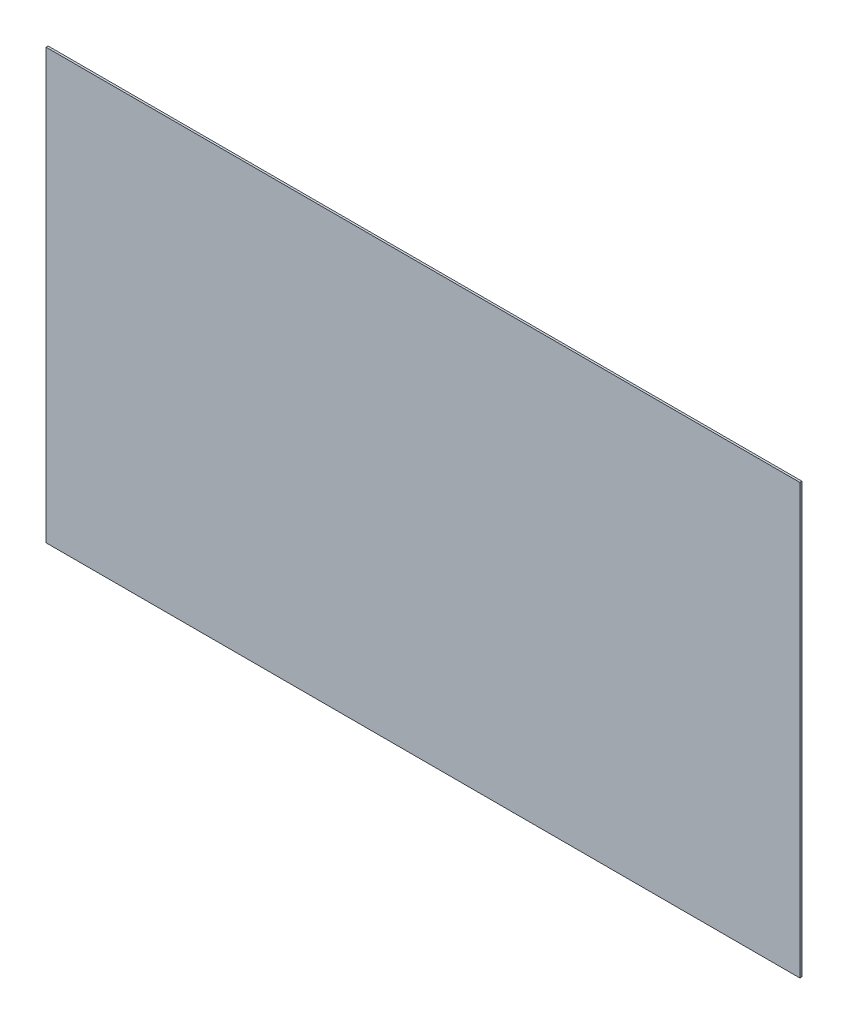
ISO-10303-21;
HEADER;
FILE_DESCRIPTION(('STEP AP214'),'2;1');
FILE_NAME('part.step','',(''),(''),'','','');
FILE_SCHEMA(('AUTOMOTIVE_DESIGN { 1 0 10303 214 1 1 1 1 }'));
ENDSEC;
DATA;
#1=APPLICATION_CONTEXT('core data for automotive mechanical design processes');
#2=APPLICATION_PROTOCOL_DEFINITION('international standard','automotive_design',2000,#1);
#3=PRODUCT_CONTEXT('',#1,'mechanical');
#4=PRODUCT('Part','Part','',(#3));
#5=PRODUCT_RELATED_PRODUCT_CATEGORY('part','',(#4));
#6=PRODUCT_DEFINITION_FORMATION('','',#4);
#7=PRODUCT_DEFINITION_CONTEXT('part definition',#1,'design');
#8=PRODUCT_DEFINITION('design','',#6,#7);
#9=PRODUCT_DEFINITION_SHAPE('','',#8);
#10=(LENGTH_UNIT() NAMED_UNIT(*) SI_UNIT(.MILLI.,.METRE.));
#11=(NAMED_UNIT(*) PLANE_ANGLE_UNIT() SI_UNIT($,.RADIAN.));
#12=(NAMED_UNIT(*) SI_UNIT($,.STERADIAN.) SOLID_ANGLE_UNIT());
#13=UNCERTAINTY_MEASURE_WITH_UNIT(LENGTH_MEASURE(1.E-05),#10,'distance_accuracy_value','');
#14=(GEOMETRIC_REPRESENTATION_CONTEXT(3) GLOBAL_UNCERTAINTY_ASSIGNED_CONTEXT((#13)) GLOBAL_UNIT_ASSIGNED_CONTEXT((#10,
#11,#12)) REPRESENTATION_CONTEXT('',''));
#15=CARTESIAN_POINT('',(0.,0.,0.));
#16=DIRECTION('',(0.,0.,1.));
#17=DIRECTION('',(1.,0.,0.));
#18=AXIS2_PLACEMENT_3D('',#15,#16,#17);
#19=CARTESIAN_POINT('',(0.,0.,2.));
#20=DIRECTION('',(1.,0.,0.));
#21=DIRECTION('',(0.,0.,-1.));
#22=AXIS2_PLACEMENT_3D('',#19,#20,#21);
#23=PLANE('',#22);
#24=DIRECTION('',(0.,-1.,0.));
#25=VECTOR('',#24,1.);
#26=CARTESIAN_POINT('',(0.,0.,0.));
#27=LINE('',#26,#25);
#28=CARTESIAN_POINT('',(0.,410.,0.));
#29=VERTEX_POINT('',#28);
#30=CARTESIAN_POINT('',(0.,0.,0.));
#31=VERTEX_POINT('',#30);
#32=EDGE_CURVE('E97',#29,#31,#27,.T.);
#33=ORIENTED_EDGE('',*,*,#32,.T.);
#34=DIRECTION('',(0.,0.,-1.));
#35=VECTOR('',#34,1.);
#36=CARTESIAN_POINT('',(0.,0.,2.));
#37=LINE('',#36,#35);
#38=CARTESIAN_POINT('',(0.,0.,2.));
#39=VERTEX_POINT('',#38);
#40=EDGE_CURVE('E11',#39,#31,#37,.T.);
#41=ORIENTED_EDGE('',*,*,#40,.F.);
#42=DIRECTION('',(0.,-1.,0.));
#43=VECTOR('',#42,1.);
#44=CARTESIAN_POINT('',(0.,0.,2.));
#45=LINE('',#44,#43);
#46=CARTESIAN_POINT('',(0.,410.,2.));
#47=VERTEX_POINT('',#46);
#48=EDGE_CURVE('E85',#47,#39,#45,.T.);
#49=ORIENTED_EDGE('',*,*,#48,.F.);
#50=DIRECTION('',(0.,0.,-1.));
#51=VECTOR('',#50,1.);
#52=CARTESIAN_POINT('',(0.,410.,2.));
#53=LINE('',#52,#51);
#54=EDGE_CURVE('E93',#47,#29,#53,.T.);
#55=ORIENTED_EDGE('',*,*,#54,.T.);
#56=EDGE_LOOP('',(#33,#41,#49,#55));
#57=FACE_BOUND('',#56,.T.);
#58=ADVANCED_FACE('F34',(#57),#23,.F.);
#59=CARTESIAN_POINT('',(0.,0.,2.));
#60=DIRECTION('',(0.,1.,0.));
#61=DIRECTION('',(0.,0.,1.));
#62=AXIS2_PLACEMENT_3D('',#59,#60,#61);
#63=PLANE('',#62);
#64=DIRECTION('',(1.,0.,0.));
#65=VECTOR('',#64,1.);
#66=CARTESIAN_POINT('',(0.,0.,0.));
#67=LINE('',#66,#65);
#68=CARTESIAN_POINT('',(720.,0.,0.));
#69=VERTEX_POINT('',#68);
#70=EDGE_CURVE('E89',#31,#69,#67,.T.);
#71=ORIENTED_EDGE('',*,*,#70,.T.);
#72=DIRECTION('',(0.,0.,-1.));
#73=VECTOR('',#72,1.);
#74=CARTESIAN_POINT('',(720.,0.,2.));
#75=LINE('',#74,#73);
#76=CARTESIAN_POINT('',(720.,0.,2.));
#77=VERTEX_POINT('',#76);
#78=EDGE_CURVE('E42',#77,#69,#75,.T.);
#79=ORIENTED_EDGE('',*,*,#78,.F.);
#80=DIRECTION('',(1.,0.,0.));
#81=VECTOR('',#80,1.);
#82=CARTESIAN_POINT('',(0.,0.,2.));
#83=LINE('',#82,#81);
#84=EDGE_CURVE('E80',#39,#77,#83,.T.);
#85=ORIENTED_EDGE('',*,*,#84,.F.);
#86=ORIENTED_EDGE('',*,*,#40,.T.);
#87=EDGE_LOOP('',(#71,#79,#85,#86));
#88=FACE_BOUND('',#87,.T.);
#89=ADVANCED_FACE('F88',(#88),#63,.F.);
#90=CARTESIAN_POINT('',(720.,0.,2.));
#91=DIRECTION('',(-1.,0.,0.));
#92=DIRECTION('',(0.,0.,1.));
#93=AXIS2_PLACEMENT_3D('',#90,#91,#92);
#94=PLANE('',#93);
#95=DIRECTION('',(0.,1.,0.));
#96=VECTOR('',#95,1.);
#97=CARTESIAN_POINT('',(720.,0.,0.));
#98=LINE('',#97,#96);
#99=CARTESIAN_POINT('',(720.,410.,0.));
#100=VERTEX_POINT('',#99);
#101=EDGE_CURVE('E67',#69,#100,#98,.T.);
#102=ORIENTED_EDGE('',*,*,#101,.T.);
#103=DIRECTION('',(0.,0.,-1.));
#104=VECTOR('',#103,1.);
#105=CARTESIAN_POINT('',(720.,410.,2.));
#106=LINE('',#105,#104);
#107=CARTESIAN_POINT('',(720.,410.,2.));
#108=VERTEX_POINT('',#107);
#109=EDGE_CURVE('E90',#108,#100,#106,.T.);
#110=ORIENTED_EDGE('',*,*,#109,.F.);
#111=DIRECTION('',(0.,1.,0.));
#112=VECTOR('',#111,1.);
#113=CARTESIAN_POINT('',(720.,0.,2.));
#114=LINE('',#113,#112);
#115=EDGE_CURVE('E83',#77,#108,#114,.T.);
#116=ORIENTED_EDGE('',*,*,#115,.F.);
#117=ORIENTED_EDGE('',*,*,#78,.T.);
#118=EDGE_LOOP('',(#102,#110,#116,#117));
#119=FACE_BOUND('',#118,.T.);
#120=ADVANCED_FACE('F91',(#119),#94,.F.);
#121=CARTESIAN_POINT('',(0.,410.,2.));
#122=DIRECTION('',(0.,-1.,0.));
#123=DIRECTION('',(0.,0.,-1.));
#124=AXIS2_PLACEMENT_3D('',#121,#122,#123);
#125=PLANE('',#124);
#126=DIRECTION('',(-1.,0.,0.));
#127=VECTOR('',#126,1.);
#128=CARTESIAN_POINT('',(0.,410.,0.));
#129=LINE('',#128,#127);
#130=EDGE_CURVE('E73',#100,#29,#129,.T.);
#131=ORIENTED_EDGE('',*,*,#130,.T.);
#132=ORIENTED_EDGE('',*,*,#54,.F.);
#133=DIRECTION('',(-1.,0.,0.));
#134=VECTOR('',#133,1.);
#135=CARTESIAN_POINT('',(0.,410.,2.));
#136=LINE('',#135,#134);
#137=EDGE_CURVE('E50',#108,#47,#136,.T.);
#138=ORIENTED_EDGE('',*,*,#137,.F.);
#139=ORIENTED_EDGE('',*,*,#109,.T.);
#140=EDGE_LOOP('',(#131,#132,#138,#139));
#141=FACE_BOUND('',#140,.T.);
#142=ADVANCED_FACE('F104',(#141),#125,.F.);
#143=CARTESIAN_POINT('',(0.,0.,2.));
#144=DIRECTION('',(0.,0.,-1.));
#145=DIRECTION('',(-1.,0.,0.));
#146=AXIS2_PLACEMENT_3D('',#143,#144,#145);
#147=PLANE('',#146);
#148=ORIENTED_EDGE('',*,*,#48,.T.);
#149=ORIENTED_EDGE('',*,*,#84,.T.);
#150=ORIENTED_EDGE('',*,*,#115,.T.);
#151=ORIENTED_EDGE('',*,*,#137,.T.);
#152=EDGE_LOOP('',(#148,#149,#150,#151));
#153=FACE_BOUND('',#152,.T.);
#154=ADVANCED_FACE('F81',(#153),#147,.F.);
#155=CARTESIAN_POINT('',(0.,0.,0.));
#156=DIRECTION('',(0.,0.,-1.));
#157=DIRECTION('',(-1.,0.,0.));
#158=AXIS2_PLACEMENT_3D('',#155,#156,#157);
#159=PLANE('',#158);
#160=ORIENTED_EDGE('',*,*,#32,.F.);
#161=ORIENTED_EDGE('',*,*,#130,.F.);
#162=ORIENTED_EDGE('',*,*,#101,.F.);
#163=ORIENTED_EDGE('',*,*,#70,.F.);
#164=EDGE_LOOP('',(#160,#161,#162,#163));
#165=FACE_BOUND('',#164,.T.);
#166=ADVANCED_FACE('F107',(#165),#159,.T.);
#167=CLOSED_SHELL('',(#58,#89,#120,#142,#154,#166));
#168=MANIFOLD_SOLID_BREP('B2',#167);
#169=ADVANCED_BREP_SHAPE_REPRESENTATION('',(#18,#168),#14);
#170=SHAPE_DEFINITION_REPRESENTATION(#9,#169);
ENDSEC;
END-ISO-10303-21;
